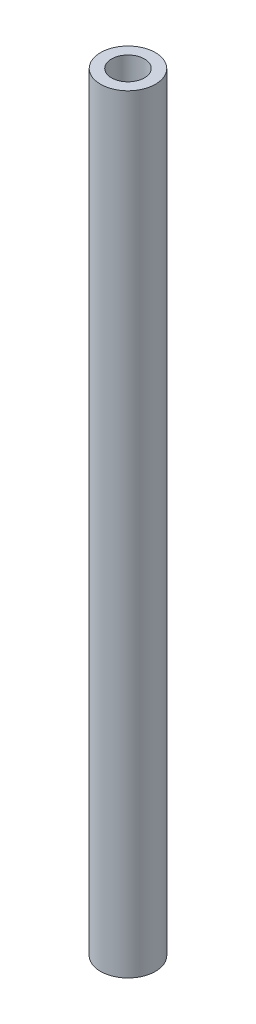
ISO-10303-21;
HEADER;
FILE_DESCRIPTION(('STEP AP214'),'2;1');
FILE_NAME('part.step','',(''),(''),'','','');
FILE_SCHEMA(('AUTOMOTIVE_DESIGN { 1 0 10303 214 1 1 1 1 }'));
ENDSEC;
DATA;
#1=APPLICATION_CONTEXT('core data for automotive mechanical design processes');
#2=APPLICATION_PROTOCOL_DEFINITION('international standard','automotive_design',2000,#1);
#3=PRODUCT_CONTEXT('',#1,'mechanical');
#4=PRODUCT('Part','Part','',(#3));
#5=PRODUCT_RELATED_PRODUCT_CATEGORY('part','',(#4));
#6=PRODUCT_DEFINITION_FORMATION('','',#4);
#7=PRODUCT_DEFINITION_CONTEXT('part definition',#1,'design');
#8=PRODUCT_DEFINITION('design','',#6,#7);
#9=PRODUCT_DEFINITION_SHAPE('','',#8);
#10=(LENGTH_UNIT() NAMED_UNIT(*) SI_UNIT(.MILLI.,.METRE.));
#11=(NAMED_UNIT(*) PLANE_ANGLE_UNIT() SI_UNIT($,.RADIAN.));
#12=(NAMED_UNIT(*) SI_UNIT($,.STERADIAN.) SOLID_ANGLE_UNIT());
#13=UNCERTAINTY_MEASURE_WITH_UNIT(LENGTH_MEASURE(1.E-05),#10,'distance_accuracy_value','');
#14=(GEOMETRIC_REPRESENTATION_CONTEXT(3) GLOBAL_UNCERTAINTY_ASSIGNED_CONTEXT((#13)) GLOBAL_UNIT_ASSIGNED_CONTEXT((#10,
#11,#12)) REPRESENTATION_CONTEXT('',''));
#15=CARTESIAN_POINT('',(0.,0.,0.));
#16=DIRECTION('',(0.,0.,1.));
#17=DIRECTION('',(1.,0.,0.));
#18=AXIS2_PLACEMENT_3D('',#15,#16,#17);
#19=CARTESIAN_POINT('',(0.,70.,0.));
#20=DIRECTION('',(0.,1.,0.));
#21=DIRECTION('',(0.,0.,1.));
#22=AXIS2_PLACEMENT_3D('',#19,#20,#21);
#23=PLANE('',#22);
#24=CARTESIAN_POINT('',(0.,70.,0.));
#25=DIRECTION('',(0.,1.,0.));
#26=DIRECTION('',(0.,0.,1.));
#27=AXIS2_PLACEMENT_3D('',#24,#25,#26);
#28=CIRCLE('',#27,2.5);
#29=CARTESIAN_POINT('',(0.,70.,2.5));
#30=VERTEX_POINT('',#29);
#31=EDGE_CURVE('E10',#30,#30,#28,.T.);
#32=ORIENTED_EDGE('',*,*,#31,.T.);
#33=EDGE_LOOP('',(#32));
#34=FACE_BOUND('',#33,.T.);
#35=CARTESIAN_POINT('',(0.,70.,0.));
#36=DIRECTION('',(0.,1.,0.));
#37=DIRECTION('',(0.,0.,1.));
#38=AXIS2_PLACEMENT_3D('',#35,#36,#37);
#39=CIRCLE('',#38,1.5);
#40=CARTESIAN_POINT('',(0.,70.,1.5));
#41=VERTEX_POINT('',#40);
#42=EDGE_CURVE('E48',#41,#41,#39,.T.);
#43=ORIENTED_EDGE('',*,*,#42,.F.);
#44=EDGE_LOOP('',(#43));
#45=FACE_BOUND('',#44,.T.);
#46=ADVANCED_FACE('F37',(#34,#45),#23,.T.);
#47=CARTESIAN_POINT('',(0.,0.,0.));
#48=DIRECTION('',(0.,1.,0.));
#49=DIRECTION('',(0.,0.,1.));
#50=AXIS2_PLACEMENT_3D('',#47,#48,#49);
#51=PLANE('',#50);
#52=CARTESIAN_POINT('',(0.,0.,0.));
#53=DIRECTION('',(0.,1.,0.));
#54=DIRECTION('',(0.,0.,1.));
#55=AXIS2_PLACEMENT_3D('',#52,#53,#54);
#56=CIRCLE('',#55,2.5);
#57=CARTESIAN_POINT('',(0.,0.,2.5));
#58=VERTEX_POINT('',#57);
#59=EDGE_CURVE('E41',#58,#58,#56,.T.);
#60=ORIENTED_EDGE('',*,*,#59,.F.);
#61=EDGE_LOOP('',(#60));
#62=FACE_BOUND('',#61,.T.);
#63=CARTESIAN_POINT('',(0.,0.,0.));
#64=DIRECTION('',(0.,1.,0.));
#65=DIRECTION('',(0.,0.,1.));
#66=AXIS2_PLACEMENT_3D('',#63,#64,#65);
#67=CIRCLE('',#66,1.5);
#68=CARTESIAN_POINT('',(0.,0.,1.5));
#69=VERTEX_POINT('',#68);
#70=EDGE_CURVE('E50',#69,#69,#67,.T.);
#71=ORIENTED_EDGE('',*,*,#70,.T.);
#72=EDGE_LOOP('',(#71));
#73=FACE_BOUND('',#72,.T.);
#74=ADVANCED_FACE('F60',(#62,#73),#51,.F.);
#75=CARTESIAN_POINT('',(0.,70.,0.));
#76=DIRECTION('',(0.,-1.,0.));
#77=DIRECTION('',(0.,0.,-1.));
#78=AXIS2_PLACEMENT_3D('',#75,#76,#77);
#79=CYLINDRICAL_SURFACE('',#78,2.5);
#80=ORIENTED_EDGE('',*,*,#31,.F.);
#81=EDGE_LOOP('',(#80));
#82=FACE_BOUND('',#81,.T.);
#83=ORIENTED_EDGE('',*,*,#59,.T.);
#84=EDGE_LOOP('',(#83));
#85=FACE_BOUND('',#84,.T.);
#86=ADVANCED_FACE('F39',(#82,#85),#79,.T.);
#87=CARTESIAN_POINT('',(0.,70.,0.));
#88=DIRECTION('',(0.,-1.,0.));
#89=DIRECTION('',(0.,0.,-1.));
#90=AXIS2_PLACEMENT_3D('',#87,#88,#89);
#91=CYLINDRICAL_SURFACE('',#90,1.5);
#92=ORIENTED_EDGE('',*,*,#42,.T.);
#93=EDGE_LOOP('',(#92));
#94=FACE_BOUND('',#93,.T.);
#95=ORIENTED_EDGE('',*,*,#70,.F.);
#96=EDGE_LOOP('',(#95));
#97=FACE_BOUND('',#96,.T.);
#98=ADVANCED_FACE('F56',(#94,#97),#91,.F.);
#99=CLOSED_SHELL('',(#46,#74,#86,#98));
#100=MANIFOLD_SOLID_BREP('B2',#99);
#101=ADVANCED_BREP_SHAPE_REPRESENTATION('',(#18,#100),#14);
#102=SHAPE_DEFINITION_REPRESENTATION(#9,#101);
ENDSEC;
END-ISO-10303-21;
